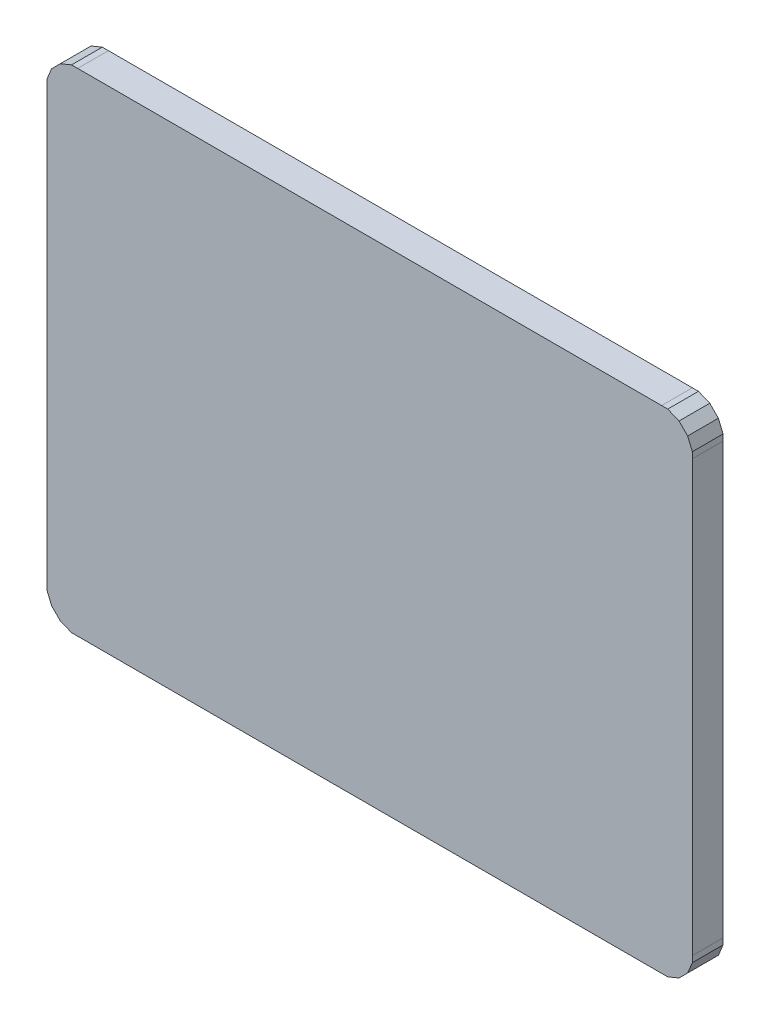
ISO-10303-21;
HEADER;
FILE_DESCRIPTION(('STEP AP214'),'2;1');
FILE_NAME('part.step','',(''),(''),'','','');
FILE_SCHEMA(('AUTOMOTIVE_DESIGN { 1 0 10303 214 1 1 1 1 }'));
ENDSEC;
DATA;
#1=APPLICATION_CONTEXT('core data for automotive mechanical design processes');
#2=APPLICATION_PROTOCOL_DEFINITION('international standard','automotive_design',2000,#1);
#3=PRODUCT_CONTEXT('',#1,'mechanical');
#4=PRODUCT('Part','Part','',(#3));
#5=PRODUCT_RELATED_PRODUCT_CATEGORY('part','',(#4));
#6=PRODUCT_DEFINITION_FORMATION('','',#4);
#7=PRODUCT_DEFINITION_CONTEXT('part definition',#1,'design');
#8=PRODUCT_DEFINITION('design','',#6,#7);
#9=PRODUCT_DEFINITION_SHAPE('','',#8);
#10=(LENGTH_UNIT() NAMED_UNIT(*) SI_UNIT(.MILLI.,.METRE.));
#11=(NAMED_UNIT(*) PLANE_ANGLE_UNIT() SI_UNIT($,.RADIAN.));
#12=(NAMED_UNIT(*) SI_UNIT($,.STERADIAN.) SOLID_ANGLE_UNIT());
#13=UNCERTAINTY_MEASURE_WITH_UNIT(LENGTH_MEASURE(1.E-05),#10,'distance_accuracy_value','');
#14=(GEOMETRIC_REPRESENTATION_CONTEXT(3) GLOBAL_UNCERTAINTY_ASSIGNED_CONTEXT((#13)) GLOBAL_UNIT_ASSIGNED_CONTEXT((#10,
#11,#12)) REPRESENTATION_CONTEXT('',''));
#15=CARTESIAN_POINT('',(0.,0.,0.));
#16=DIRECTION('',(0.,0.,1.));
#17=DIRECTION('',(1.,0.,0.));
#18=AXIS2_PLACEMENT_3D('',#15,#16,#17);
#19=CARTESIAN_POINT('',(-0.95000064,0.80000094,0.0999998));
#20=DIRECTION('',(0.,0.,-1.));
#21=DIRECTION('',(0.,-1.,0.));
#22=AXIS2_PLACEMENT_3D('',#19,#20,#21);
#23=PLANE('',#22);
#24=DIRECTION('',(-1.,0.,0.));
#25=VECTOR('',#24,1.);
#26=CARTESIAN_POINT('',(-0.95000064,0.80000094,0.0999998));
#27=LINE('',#26,#25);
#28=CARTESIAN_POINT('',(-0.95000064,0.80000094,0.0999998));
#29=VERTEX_POINT('',#28);
#30=CARTESIAN_POINT('',(-0.96989392,0.80000094,0.0999998));
#31=VERTEX_POINT('',#30);
#32=EDGE_CURVE('E565',#29,#31,#27,.T.);
#33=ORIENTED_EDGE('',*,*,#32,.T.);
#34=DIRECTION('',(-0.923872088680071,-0.38270140286903,0.));
#35=VECTOR('',#34,1.);
#36=CARTESIAN_POINT('',(-0.96989392,0.80000094,0.0999998));
#37=LINE('',#36,#35);
#38=CARTESIAN_POINT('',(-1.00664772,0.78477618,0.0999998));
#39=VERTEX_POINT('',#38);
#40=EDGE_CURVE('E373',#31,#39,#37,.T.);
#41=ORIENTED_EDGE('',*,*,#40,.T.);
#42=DIRECTION('',(-0.707106781185048,-0.707106781188048,0.));
#43=VECTOR('',#42,1.);
#44=CARTESIAN_POINT('',(-1.00664772,0.78477618,0.0999998));
#45=LINE('',#44,#43);
#46=CARTESIAN_POINT('',(-1.03477822,0.75664568,0.0999998));
#47=VERTEX_POINT('',#46);
#48=EDGE_CURVE('E389',#39,#47,#45,.T.);
#49=ORIENTED_EDGE('',*,*,#48,.T.);
#50=DIRECTION('',(-0.38264690457598,-0.923894661970953,0.));
#51=VECTOR('',#50,1.);
#52=CARTESIAN_POINT('',(-1.03477822,0.75664568,0.0999998));
#53=LINE('',#52,#51);
#54=CARTESIAN_POINT('',(-1.05000044,0.71989188,0.0999998));
#55=VERTEX_POINT('',#54);
#56=EDGE_CURVE('E394',#47,#55,#53,.T.);
#57=ORIENTED_EDGE('',*,*,#56,.T.);
#58=DIRECTION('',(0.,-1.,0.));
#59=VECTOR('',#58,1.);
#60=CARTESIAN_POINT('',(-1.05000044,0.71989188,0.0999998));
#61=LINE('',#60,#59);
#62=CARTESIAN_POINT('',(-1.05000044,0.70000114,0.0999998));
#63=VERTEX_POINT('',#62);
#64=EDGE_CURVE('E407',#55,#63,#61,.T.);
#65=ORIENTED_EDGE('',*,*,#64,.T.);
#66=DIRECTION('',(0.,-1.,0.));
#67=VECTOR('',#66,1.);
#68=CARTESIAN_POINT('',(-1.05000044,0.70000114,0.0999998));
#69=LINE('',#68,#67);
#70=CARTESIAN_POINT('',(-1.05000044,-0.70000114,0.0999998));
#71=VERTEX_POINT('',#70);
#72=EDGE_CURVE('E422',#63,#71,#69,.T.);
#73=ORIENTED_EDGE('',*,*,#72,.T.);
#74=DIRECTION('',(0.,-1.,0.));
#75=VECTOR('',#74,1.);
#76=CARTESIAN_POINT('',(-1.05000044,-0.70000114,0.0999998));
#77=LINE('',#76,#75);
#78=CARTESIAN_POINT('',(-1.05000044,-0.71989442,0.0999998));
#79=VERTEX_POINT('',#78);
#80=EDGE_CURVE('E437',#71,#79,#77,.T.);
#81=ORIENTED_EDGE('',*,*,#80,.T.);
#82=DIRECTION('',(0.382646904575127,-0.923894661971306,0.));
#83=VECTOR('',#82,1.);
#84=CARTESIAN_POINT('',(-1.05000044,-0.71989442,0.0999998));
#85=LINE('',#84,#83);
#86=CARTESIAN_POINT('',(-1.03477822,-0.75664822,0.0999998));
#87=VERTEX_POINT('',#86);
#88=EDGE_CURVE('E384',#79,#87,#85,.T.);
#89=ORIENTED_EDGE('',*,*,#88,.T.);
#90=DIRECTION('',(0.707106781186548,-0.707106781186548,0.));
#91=VECTOR('',#90,1.);
#92=CARTESIAN_POINT('',(-1.03477822,-0.75664822,0.0999998));
#93=LINE('',#92,#91);
#94=CARTESIAN_POINT('',(-1.00664772,-0.78477872,0.0999998));
#95=VERTEX_POINT('',#94);
#96=EDGE_CURVE('E461',#87,#95,#93,.T.);
#97=ORIENTED_EDGE('',*,*,#96,.T.);
#98=DIRECTION('',(0.92389466197216,-0.382646904573066,0.));
#99=VECTOR('',#98,1.);
#100=CARTESIAN_POINT('',(-1.00664772,-0.78477872,0.0999998));
#101=LINE('',#100,#99);
#102=CARTESIAN_POINT('',(-0.96989392,-0.80000094,0.0999998));
#103=VERTEX_POINT('',#102);
#104=EDGE_CURVE('E476',#95,#103,#101,.T.);
#105=ORIENTED_EDGE('',*,*,#104,.T.);
#106=DIRECTION('',(1.,0.,0.));
#107=VECTOR('',#106,1.);
#108=CARTESIAN_POINT('',(-0.96989392,-0.80000094,0.0999998));
#109=LINE('',#108,#107);
#110=CARTESIAN_POINT('',(-0.95000064,-0.80000094,0.0999998));
#111=VERTEX_POINT('',#110);
#112=EDGE_CURVE('E452',#103,#111,#109,.T.);
#113=ORIENTED_EDGE('',*,*,#112,.T.);
#114=DIRECTION('',(1.,0.,0.));
#115=VECTOR('',#114,1.);
#116=CARTESIAN_POINT('',(-0.95000064,-0.80000094,0.0999998));
#117=LINE('',#116,#115);
#118=CARTESIAN_POINT('',(0.95000064,-0.80000094,0.0999998));
#119=VERTEX_POINT('',#118);
#120=EDGE_CURVE('E275',#111,#119,#117,.T.);
#121=ORIENTED_EDGE('',*,*,#120,.T.);
#122=DIRECTION('',(1.,0.,0.));
#123=VECTOR('',#122,1.);
#124=CARTESIAN_POINT('',(0.95000064,-0.80000094,0.0999998));
#125=LINE('',#124,#123);
#126=CARTESIAN_POINT('',(0.96989138,-0.80000094,0.0999998));
#127=VERTEX_POINT('',#126);
#128=EDGE_CURVE('E282',#119,#127,#125,.T.);
#129=ORIENTED_EDGE('',*,*,#128,.T.);
#130=DIRECTION('',(0.923894661971806,0.38264690457392,0.));
#131=VECTOR('',#130,1.);
#132=CARTESIAN_POINT('',(0.96989138,-0.80000094,0.0999998));
#133=LINE('',#132,#131);
#134=CARTESIAN_POINT('',(1.00664518,-0.78477872,0.0999998));
#135=VERTEX_POINT('',#134);
#136=EDGE_CURVE('E297',#127,#135,#133,.T.);
#137=ORIENTED_EDGE('',*,*,#136,.T.);
#138=DIRECTION('',(0.707106781186548,0.707106781186548,0.));
#139=VECTOR('',#138,1.);
#140=CARTESIAN_POINT('',(1.00664518,-0.78477872,0.0999998));
#141=LINE('',#140,#139);
#142=CARTESIAN_POINT('',(1.03477568,-0.75664822,0.0999998));
#143=VERTEX_POINT('',#142);
#144=EDGE_CURVE('E306',#135,#143,#141,.T.);
#145=ORIENTED_EDGE('',*,*,#144,.T.);
#146=DIRECTION('',(0.38270140287109,0.923872088679217,0.));
#147=VECTOR('',#146,1.);
#148=CARTESIAN_POINT('',(1.03477568,-0.75664822,0.0999998));
#149=LINE('',#148,#147);
#150=CARTESIAN_POINT('',(1.05000044,-0.71989442,0.0999998));
#151=VERTEX_POINT('',#150);
#152=EDGE_CURVE('E321',#143,#151,#149,.T.);
#153=ORIENTED_EDGE('',*,*,#152,.T.);
#154=DIRECTION('',(0.,1.,0.));
#155=VECTOR('',#154,1.);
#156=CARTESIAN_POINT('',(1.05000044,-0.71989442,0.0999998));
#157=LINE('',#156,#155);
#158=CARTESIAN_POINT('',(1.05000044,-0.70000114,0.0999998));
#159=VERTEX_POINT('',#158);
#160=EDGE_CURVE('E307',#151,#159,#157,.T.);
#161=ORIENTED_EDGE('',*,*,#160,.T.);
#162=DIRECTION('',(0.,1.,0.));
#163=VECTOR('',#162,1.);
#164=CARTESIAN_POINT('',(1.05000044,-0.70000114,0.0999998));
#165=LINE('',#164,#163);
#166=CARTESIAN_POINT('',(1.05000044,0.70000114,0.0999998));
#167=VERTEX_POINT('',#166);
#168=EDGE_CURVE('E335',#159,#167,#165,.T.);
#169=ORIENTED_EDGE('',*,*,#168,.T.);
#170=DIRECTION('',(0.,1.,0.));
#171=VECTOR('',#170,1.);
#172=CARTESIAN_POINT('',(1.05000044,0.70000114,0.0999998));
#173=LINE('',#172,#171);
#174=CARTESIAN_POINT('',(1.05000044,0.71989188,0.0999998));
#175=VERTEX_POINT('',#174);
#176=EDGE_CURVE('E344',#167,#175,#173,.T.);
#177=ORIENTED_EDGE('',*,*,#176,.T.);
#178=DIRECTION('',(-0.382701402871944,0.923872088678864,0.));
#179=VECTOR('',#178,1.);
#180=CARTESIAN_POINT('',(1.05000044,0.71989188,0.0999998));
#181=LINE('',#180,#179);
#182=CARTESIAN_POINT('',(1.03477568,0.75664568,0.0999998));
#183=VERTEX_POINT('',#182);
#184=EDGE_CURVE('E261',#175,#183,#181,.T.);
#185=ORIENTED_EDGE('',*,*,#184,.T.);
#186=DIRECTION('',(-0.707106781185048,0.707106781188048,0.));
#187=VECTOR('',#186,1.);
#188=CARTESIAN_POINT('',(1.03477568,0.75664568,0.0999998));
#189=LINE('',#188,#187);
#190=CARTESIAN_POINT('',(1.00664518,0.78477618,0.0999998));
#191=VERTEX_POINT('',#190);
#192=EDGE_CURVE('E251',#183,#191,#189,.T.);
#193=ORIENTED_EDGE('',*,*,#192,.T.);
#194=DIRECTION('',(-0.923872088679717,0.382701402869883,0.));
#195=VECTOR('',#194,1.);
#196=CARTESIAN_POINT('',(1.00664518,0.78477618,0.0999998));
#197=LINE('',#196,#195);
#198=CARTESIAN_POINT('',(0.96989138,0.80000094,0.0999998));
#199=VERTEX_POINT('',#198);
#200=EDGE_CURVE('E236',#191,#199,#197,.T.);
#201=ORIENTED_EDGE('',*,*,#200,.T.);
#202=DIRECTION('',(-1.,0.,0.));
#203=VECTOR('',#202,1.);
#204=CARTESIAN_POINT('',(0.96989138,0.80000094,0.0999998));
#205=LINE('',#204,#203);
#206=CARTESIAN_POINT('',(0.95000064,0.80000094,0.0999998));
#207=VERTEX_POINT('',#206);
#208=EDGE_CURVE('E241',#199,#207,#205,.T.);
#209=ORIENTED_EDGE('',*,*,#208,.T.);
#210=DIRECTION('',(-1.,0.,0.));
#211=VECTOR('',#210,1.);
#212=CARTESIAN_POINT('',(0.95000064,0.80000094,0.0999998));
#213=LINE('',#212,#211);
#214=EDGE_CURVE('E11',#207,#29,#213,.T.);
#215=ORIENTED_EDGE('',*,*,#214,.T.);
#216=EDGE_LOOP('',(#33,#41,#49,#57,#65,#73,#81,#89,#97,#105,#113,#121,#129,#137,#145,#153,#161,
#169,#177,#185,#193,#201,#209,#215));
#217=FACE_BOUND('',#216,.T.);
#218=ADVANCED_FACE('F17',(#217),#23,.F.);
#219=CARTESIAN_POINT('',(-0.95000064,0.80000094,0.));
#220=DIRECTION('',(0.,0.,-1.));
#221=DIRECTION('',(0.,-1.,0.));
#222=AXIS2_PLACEMENT_3D('',#219,#220,#221);
#223=PLANE('',#222);
#224=DIRECTION('',(-1.,0.,0.));
#225=VECTOR('',#224,1.);
#226=CARTESIAN_POINT('',(0.95000064,0.80000094,0.));
#227=LINE('',#226,#225);
#228=CARTESIAN_POINT('',(0.95000064,0.80000094,0.));
#229=VERTEX_POINT('',#228);
#230=CARTESIAN_POINT('',(-0.95000064,0.80000094,0.));
#231=VERTEX_POINT('',#230);
#232=EDGE_CURVE('E20',#229,#231,#227,.T.);
#233=ORIENTED_EDGE('',*,*,#232,.F.);
#234=DIRECTION('',(-1.,0.,0.));
#235=VECTOR('',#234,1.);
#236=CARTESIAN_POINT('',(0.96989138,0.80000094,0.));
#237=LINE('',#236,#235);
#238=CARTESIAN_POINT('',(0.96989138,0.80000094,0.));
#239=VERTEX_POINT('',#238);
#240=EDGE_CURVE('E225',#239,#229,#237,.T.);
#241=ORIENTED_EDGE('',*,*,#240,.F.);
#242=DIRECTION('',(-0.923872088679717,0.382701402869883,0.));
#243=VECTOR('',#242,1.);
#244=CARTESIAN_POINT('',(1.00664518,0.78477618,0.));
#245=LINE('',#244,#243);
#246=CARTESIAN_POINT('',(1.00664518,0.78477618,0.));
#247=VERTEX_POINT('',#246);
#248=EDGE_CURVE('E229',#247,#239,#245,.T.);
#249=ORIENTED_EDGE('',*,*,#248,.F.);
#250=DIRECTION('',(-0.707106781185048,0.707106781188048,0.));
#251=VECTOR('',#250,1.);
#252=CARTESIAN_POINT('',(1.03477568,0.75664568,0.));
#253=LINE('',#252,#251);
#254=CARTESIAN_POINT('',(1.03477568,0.75664568,0.));
#255=VERTEX_POINT('',#254);
#256=EDGE_CURVE('E289',#255,#247,#253,.T.);
#257=ORIENTED_EDGE('',*,*,#256,.F.);
#258=DIRECTION('',(-0.382701402871944,0.923872088678864,0.));
#259=VECTOR('',#258,1.);
#260=CARTESIAN_POINT('',(1.05000044,0.71989188,0.));
#261=LINE('',#260,#259);
#262=CARTESIAN_POINT('',(1.05000044,0.71989188,0.));
#263=VERTEX_POINT('',#262);
#264=EDGE_CURVE('E345',#263,#255,#261,.T.);
#265=ORIENTED_EDGE('',*,*,#264,.F.);
#266=DIRECTION('',(0.,1.,0.));
#267=VECTOR('',#266,1.);
#268=CARTESIAN_POINT('',(1.05000044,0.70000114,0.));
#269=LINE('',#268,#267);
#270=CARTESIAN_POINT('',(1.05000044,0.70000114,0.));
#271=VERTEX_POINT('',#270);
#272=EDGE_CURVE('E339',#271,#263,#269,.T.);
#273=ORIENTED_EDGE('',*,*,#272,.F.);
#274=DIRECTION('',(0.,1.,0.));
#275=VECTOR('',#274,1.);
#276=CARTESIAN_POINT('',(1.05000044,-0.70000114,0.));
#277=LINE('',#276,#275);
#278=CARTESIAN_POINT('',(1.05000044,-0.70000114,0.));
#279=VERTEX_POINT('',#278);
#280=EDGE_CURVE('E311',#279,#271,#277,.T.);
#281=ORIENTED_EDGE('',*,*,#280,.F.);
#282=DIRECTION('',(0.,1.,0.));
#283=VECTOR('',#282,1.);
#284=CARTESIAN_POINT('',(1.05000044,-0.71989442,0.));
#285=LINE('',#284,#283);
#286=CARTESIAN_POINT('',(1.05000044,-0.71989442,0.));
#287=VERTEX_POINT('',#286);
#288=EDGE_CURVE('E325',#287,#279,#285,.T.);
#289=ORIENTED_EDGE('',*,*,#288,.F.);
#290=DIRECTION('',(0.38270140287109,0.923872088679217,0.));
#291=VECTOR('',#290,1.);
#292=CARTESIAN_POINT('',(1.03477568,-0.75664822,0.));
#293=LINE('',#292,#291);
#294=CARTESIAN_POINT('',(1.03477568,-0.75664822,0.));
#295=VERTEX_POINT('',#294);
#296=EDGE_CURVE('E316',#295,#287,#293,.T.);
#297=ORIENTED_EDGE('',*,*,#296,.F.);
#298=DIRECTION('',(0.707106781186548,0.707106781186548,0.));
#299=VECTOR('',#298,1.);
#300=CARTESIAN_POINT('',(1.00664518,-0.78477872,0.));
#301=LINE('',#300,#299);
#302=CARTESIAN_POINT('',(1.00664518,-0.78477872,0.));
#303=VERTEX_POINT('',#302);
#304=EDGE_CURVE('E301',#303,#295,#301,.T.);
#305=ORIENTED_EDGE('',*,*,#304,.F.);
#306=DIRECTION('',(0.923894661971806,0.38264690457392,0.));
#307=VECTOR('',#306,1.);
#308=CARTESIAN_POINT('',(0.96989138,-0.80000094,0.));
#309=LINE('',#308,#307);
#310=CARTESIAN_POINT('',(0.96989138,-0.80000094,0.));
#311=VERTEX_POINT('',#310);
#312=EDGE_CURVE('E286',#311,#303,#309,.T.);
#313=ORIENTED_EDGE('',*,*,#312,.F.);
#314=DIRECTION('',(1.,0.,0.));
#315=VECTOR('',#314,1.);
#316=CARTESIAN_POINT('',(0.95000064,-0.80000094,0.));
#317=LINE('',#316,#315);
#318=CARTESIAN_POINT('',(0.95000064,-0.80000094,0.));
#319=VERTEX_POINT('',#318);
#320=EDGE_CURVE('E277',#319,#311,#317,.T.);
#321=ORIENTED_EDGE('',*,*,#320,.F.);
#322=DIRECTION('',(1.,0.,0.));
#323=VECTOR('',#322,1.);
#324=CARTESIAN_POINT('',(-0.95000064,-0.80000094,0.));
#325=LINE('',#324,#323);
#326=CARTESIAN_POINT('',(-0.95000064,-0.80000094,0.));
#327=VERTEX_POINT('',#326);
#328=EDGE_CURVE('E456',#327,#319,#325,.T.);
#329=ORIENTED_EDGE('',*,*,#328,.F.);
#330=DIRECTION('',(1.,0.,0.));
#331=VECTOR('',#330,1.);
#332=CARTESIAN_POINT('',(-0.96989392,-0.80000094,0.));
#333=LINE('',#332,#331);
#334=CARTESIAN_POINT('',(-0.96989392,-0.80000094,0.));
#335=VERTEX_POINT('',#334);
#336=EDGE_CURVE('E480',#335,#327,#333,.T.);
#337=ORIENTED_EDGE('',*,*,#336,.F.);
#338=DIRECTION('',(0.92389466197216,-0.382646904573066,0.));
#339=VECTOR('',#338,1.);
#340=CARTESIAN_POINT('',(-1.00664772,-0.78477872,0.));
#341=LINE('',#340,#339);
#342=CARTESIAN_POINT('',(-1.00664772,-0.78477872,0.));
#343=VERTEX_POINT('',#342);
#344=EDGE_CURVE('E468',#343,#335,#341,.T.);
#345=ORIENTED_EDGE('',*,*,#344,.F.);
#346=DIRECTION('',(0.707106781186548,-0.707106781186548,0.));
#347=VECTOR('',#346,1.);
#348=CARTESIAN_POINT('',(-1.03477822,-0.75664822,0.));
#349=LINE('',#348,#347);
#350=CARTESIAN_POINT('',(-1.03477822,-0.75664822,0.));
#351=VERTEX_POINT('',#350);
#352=EDGE_CURVE('E447',#351,#343,#349,.T.);
#353=ORIENTED_EDGE('',*,*,#352,.F.);
#354=DIRECTION('',(0.382646904575127,-0.923894661971306,0.));
#355=VECTOR('',#354,1.);
#356=CARTESIAN_POINT('',(-1.05000044,-0.71989442,0.));
#357=LINE('',#356,#355);
#358=CARTESIAN_POINT('',(-1.05000044,-0.71989442,0.));
#359=VERTEX_POINT('',#358);
#360=EDGE_CURVE('E385',#359,#351,#357,.T.);
#361=ORIENTED_EDGE('',*,*,#360,.F.);
#362=DIRECTION('',(0.,-1.,0.));
#363=VECTOR('',#362,1.);
#364=CARTESIAN_POINT('',(-1.05000044,-0.70000114,0.));
#365=LINE('',#364,#363);
#366=CARTESIAN_POINT('',(-1.05000044,-0.70000114,0.));
#367=VERTEX_POINT('',#366);
#368=EDGE_CURVE('E426',#367,#359,#365,.T.);
#369=ORIENTED_EDGE('',*,*,#368,.F.);
#370=DIRECTION('',(0.,-1.,0.));
#371=VECTOR('',#370,1.);
#372=CARTESIAN_POINT('',(-1.05000044,0.70000114,0.));
#373=LINE('',#372,#371);
#374=CARTESIAN_POINT('',(-1.05000044,0.70000114,0.));
#375=VERTEX_POINT('',#374);
#376=EDGE_CURVE('E414',#375,#367,#373,.T.);
#377=ORIENTED_EDGE('',*,*,#376,.F.);
#378=DIRECTION('',(0.,-1.,0.));
#379=VECTOR('',#378,1.);
#380=CARTESIAN_POINT('',(-1.05000044,0.71989188,0.));
#381=LINE('',#380,#379);
#382=CARTESIAN_POINT('',(-1.05000044,0.71989188,0.));
#383=VERTEX_POINT('',#382);
#384=EDGE_CURVE('E396',#383,#375,#381,.T.);
#385=ORIENTED_EDGE('',*,*,#384,.F.);
#386=DIRECTION('',(-0.38264690457598,-0.923894661970953,0.));
#387=VECTOR('',#386,1.);
#388=CARTESIAN_POINT('',(-1.03477822,0.75664568,0.));
#389=LINE('',#388,#387);
#390=CARTESIAN_POINT('',(-1.03477822,0.75664568,0.));
#391=VERTEX_POINT('',#390);
#392=EDGE_CURVE('E395',#391,#383,#389,.T.);
#393=ORIENTED_EDGE('',*,*,#392,.F.);
#394=DIRECTION('',(-0.707106781185048,-0.707106781188048,0.));
#395=VECTOR('',#394,1.);
#396=CARTESIAN_POINT('',(-1.00664772,0.78477618,0.));
#397=LINE('',#396,#395);
#398=CARTESIAN_POINT('',(-1.00664772,0.78477618,0.));
#399=VERTEX_POINT('',#398);
#400=EDGE_CURVE('E375',#399,#391,#397,.T.);
#401=ORIENTED_EDGE('',*,*,#400,.F.);
#402=DIRECTION('',(-0.923872088680071,-0.38270140286903,0.));
#403=VECTOR('',#402,1.);
#404=CARTESIAN_POINT('',(-0.96989392,0.80000094,0.));
#405=LINE('',#404,#403);
#406=CARTESIAN_POINT('',(-0.96989392,0.80000094,0.));
#407=VERTEX_POINT('',#406);
#408=EDGE_CURVE('E545',#407,#399,#405,.T.);
#409=ORIENTED_EDGE('',*,*,#408,.F.);
#410=DIRECTION('',(-1.,0.,0.));
#411=VECTOR('',#410,1.);
#412=CARTESIAN_POINT('',(-0.95000064,0.80000094,0.));
#413=LINE('',#412,#411);
#414=EDGE_CURVE('E975',#231,#407,#413,.T.);
#415=ORIENTED_EDGE('',*,*,#414,.F.);
#416=EDGE_LOOP('',(#233,#241,#249,#257,#265,#273,#281,#289,#297,#305,#313,#321,#329,#337,#345,
#353,#361,#369,#377,#385,#393,#401,#409,#415));
#417=FACE_BOUND('',#416,.T.);
#418=ADVANCED_FACE('F227',(#417),#223,.T.);
#419=CARTESIAN_POINT('',(0.95000064,0.80000094,0.));
#420=DIRECTION('',(0.,-1.,0.));
#421=DIRECTION('',(0.,0.,-1.));
#422=AXIS2_PLACEMENT_3D('',#419,#420,#421);
#423=PLANE('',#422);
#424=ORIENTED_EDGE('',*,*,#232,.T.);
#425=DIRECTION('',(0.,0.,1.));
#426=VECTOR('',#425,1.);
#427=CARTESIAN_POINT('',(-0.95000064,0.80000094,0.));
#428=LINE('',#427,#426);
#429=EDGE_CURVE('E560',#231,#29,#428,.T.);
#430=ORIENTED_EDGE('',*,*,#429,.T.);
#431=ORIENTED_EDGE('',*,*,#214,.F.);
#432=DIRECTION('',(0.,0.,1.));
#433=VECTOR('',#432,1.);
#434=CARTESIAN_POINT('',(0.95000064,0.80000094,0.));
#435=LINE('',#434,#433);
#436=EDGE_CURVE('E235',#229,#207,#435,.T.);
#437=ORIENTED_EDGE('',*,*,#436,.F.);
#438=EDGE_LOOP('',(#424,#430,#431,#437));
#439=FACE_BOUND('',#438,.T.);
#440=ADVANCED_FACE('F747',(#439),#423,.F.);
#441=CARTESIAN_POINT('',(0.96989138,0.80000094,0.));
#442=DIRECTION('',(0.,-1.,0.));
#443=DIRECTION('',(0.,0.,-1.));
#444=AXIS2_PLACEMENT_3D('',#441,#442,#443);
#445=PLANE('',#444);
#446=ORIENTED_EDGE('',*,*,#240,.T.);
#447=ORIENTED_EDGE('',*,*,#436,.T.);
#448=ORIENTED_EDGE('',*,*,#208,.F.);
#449=DIRECTION('',(0.,0.,1.));
#450=VECTOR('',#449,1.);
#451=CARTESIAN_POINT('',(0.96989138,0.80000094,0.));
#452=LINE('',#451,#450);
#453=EDGE_CURVE('E239',#239,#199,#452,.T.);
#454=ORIENTED_EDGE('',*,*,#453,.F.);
#455=EDGE_LOOP('',(#446,#447,#448,#454));
#456=FACE_BOUND('',#455,.T.);
#457=ADVANCED_FACE('F240',(#456),#445,.F.);
#458=CARTESIAN_POINT('',(1.00664518,0.78477618,0.));
#459=DIRECTION('',(-0.382701402869883,-0.923872088679717,0.));
#460=DIRECTION('',(-0.923872088679717,0.382701402869883,0.));
#461=AXIS2_PLACEMENT_3D('',#458,#459,#460);
#462=PLANE('',#461);
#463=ORIENTED_EDGE('',*,*,#248,.T.);
#464=ORIENTED_EDGE('',*,*,#453,.T.);
#465=ORIENTED_EDGE('',*,*,#200,.F.);
#466=DIRECTION('',(0.,0.,1.));
#467=VECTOR('',#466,1.);
#468=CARTESIAN_POINT('',(1.00664518,0.78477618,0.));
#469=LINE('',#468,#467);
#470=EDGE_CURVE('E248',#247,#191,#469,.T.);
#471=ORIENTED_EDGE('',*,*,#470,.F.);
#472=EDGE_LOOP('',(#463,#464,#465,#471));
#473=FACE_BOUND('',#472,.T.);
#474=ADVANCED_FACE('F246',(#473),#462,.F.);
#475=CARTESIAN_POINT('',(1.03477568,0.75664568,0.));
#476=DIRECTION('',(-0.707106781188048,-0.707106781185048,0.));
#477=DIRECTION('',(-0.707106781185048,0.707106781188048,0.));
#478=AXIS2_PLACEMENT_3D('',#475,#476,#477);
#479=PLANE('',#478);
#480=ORIENTED_EDGE('',*,*,#256,.T.);
#481=ORIENTED_EDGE('',*,*,#470,.T.);
#482=ORIENTED_EDGE('',*,*,#192,.F.);
#483=DIRECTION('',(0.,0.,1.));
#484=VECTOR('',#483,1.);
#485=CARTESIAN_POINT('',(1.03477568,0.75664568,0.));
#486=LINE('',#485,#484);
#487=EDGE_CURVE('E348',#255,#183,#486,.T.);
#488=ORIENTED_EDGE('',*,*,#487,.F.);
#489=EDGE_LOOP('',(#480,#481,#482,#488));
#490=FACE_BOUND('',#489,.T.);
#491=ADVANCED_FACE('F862',(#490),#479,.F.);
#492=CARTESIAN_POINT('',(1.05000044,0.71989188,0.));
#493=DIRECTION('',(-0.923872088678864,-0.382701402871944,0.));
#494=DIRECTION('',(-0.382701402871944,0.923872088678864,0.));
#495=AXIS2_PLACEMENT_3D('',#492,#493,#494);
#496=PLANE('',#495);
#497=ORIENTED_EDGE('',*,*,#264,.T.);
#498=ORIENTED_EDGE('',*,*,#487,.T.);
#499=ORIENTED_EDGE('',*,*,#184,.F.);
#500=DIRECTION('',(0.,0.,1.));
#501=VECTOR('',#500,1.);
#502=CARTESIAN_POINT('',(1.05000044,0.71989188,0.));
#503=LINE('',#502,#501);
#504=EDGE_CURVE('E340',#263,#175,#503,.T.);
#505=ORIENTED_EDGE('',*,*,#504,.F.);
#506=EDGE_LOOP('',(#497,#498,#499,#505));
#507=FACE_BOUND('',#506,.T.);
#508=ADVANCED_FACE('F362',(#507),#496,.F.);
#509=CARTESIAN_POINT('',(1.05000044,0.70000114,0.));
#510=DIRECTION('',(-1.,0.,0.));
#511=DIRECTION('',(0.,0.,1.));
#512=AXIS2_PLACEMENT_3D('',#509,#510,#511);
#513=PLANE('',#512);
#514=ORIENTED_EDGE('',*,*,#272,.T.);
#515=ORIENTED_EDGE('',*,*,#504,.T.);
#516=ORIENTED_EDGE('',*,*,#176,.F.);
#517=DIRECTION('',(0.,0.,1.));
#518=VECTOR('',#517,1.);
#519=CARTESIAN_POINT('',(1.05000044,0.70000114,0.));
#520=LINE('',#519,#518);
#521=EDGE_CURVE('E329',#271,#167,#520,.T.);
#522=ORIENTED_EDGE('',*,*,#521,.F.);
#523=EDGE_LOOP('',(#514,#515,#516,#522));
#524=FACE_BOUND('',#523,.T.);
#525=ADVANCED_FACE('F366',(#524),#513,.F.);
#526=CARTESIAN_POINT('',(1.05000044,-0.70000114,0.));
#527=DIRECTION('',(-1.,0.,0.));
#528=DIRECTION('',(0.,0.,1.));
#529=AXIS2_PLACEMENT_3D('',#526,#527,#528);
#530=PLANE('',#529);
#531=ORIENTED_EDGE('',*,*,#280,.T.);
#532=ORIENTED_EDGE('',*,*,#521,.T.);
#533=ORIENTED_EDGE('',*,*,#168,.F.);
#534=DIRECTION('',(0.,0.,1.));
#535=VECTOR('',#534,1.);
#536=CARTESIAN_POINT('',(1.05000044,-0.70000114,0.));
#537=LINE('',#536,#535);
#538=EDGE_CURVE('E312',#279,#159,#537,.T.);
#539=ORIENTED_EDGE('',*,*,#538,.F.);
#540=EDGE_LOOP('',(#531,#532,#533,#539));
#541=FACE_BOUND('',#540,.T.);
#542=ADVANCED_FACE('F708',(#541),#530,.F.);
#543=CARTESIAN_POINT('',(1.05000044,-0.71989442,0.));
#544=DIRECTION('',(-1.,0.,0.));
#545=DIRECTION('',(0.,0.,1.));
#546=AXIS2_PLACEMENT_3D('',#543,#544,#545);
#547=PLANE('',#546);
#548=ORIENTED_EDGE('',*,*,#288,.T.);
#549=ORIENTED_EDGE('',*,*,#538,.T.);
#550=ORIENTED_EDGE('',*,*,#160,.F.);
#551=DIRECTION('',(0.,0.,1.));
#552=VECTOR('',#551,1.);
#553=CARTESIAN_POINT('',(1.05000044,-0.71989442,0.));
#554=LINE('',#553,#552);
#555=EDGE_CURVE('E317',#287,#151,#554,.T.);
#556=ORIENTED_EDGE('',*,*,#555,.F.);
#557=EDGE_LOOP('',(#548,#549,#550,#556));
#558=FACE_BOUND('',#557,.T.);
#559=ADVANCED_FACE('F703',(#558),#547,.F.);
#560=CARTESIAN_POINT('',(1.03477568,-0.75664822,0.));
#561=DIRECTION('',(-0.923872088679217,0.38270140287109,0.));
#562=DIRECTION('',(0.,0.,1.));
#563=AXIS2_PLACEMENT_3D('',#560,#561,#562);
#564=PLANE('',#563);
#565=ORIENTED_EDGE('',*,*,#296,.T.);
#566=ORIENTED_EDGE('',*,*,#555,.T.);
#567=ORIENTED_EDGE('',*,*,#152,.F.);
#568=DIRECTION('',(0.,0.,1.));
#569=VECTOR('',#568,1.);
#570=CARTESIAN_POINT('',(1.03477568,-0.75664822,0.));
#571=LINE('',#570,#569);
#572=EDGE_CURVE('E302',#295,#143,#571,.T.);
#573=ORIENTED_EDGE('',*,*,#572,.F.);
#574=EDGE_LOOP('',(#565,#566,#567,#573));
#575=FACE_BOUND('',#574,.T.);
#576=ADVANCED_FACE('F507',(#575),#564,.F.);
#577=CARTESIAN_POINT('',(1.00664518,-0.78477872,0.));
#578=DIRECTION('',(-0.707106781186548,0.707106781186548,0.));
#579=DIRECTION('',(0.,0.,1.));
#580=AXIS2_PLACEMENT_3D('',#577,#578,#579);
#581=PLANE('',#580);
#582=ORIENTED_EDGE('',*,*,#304,.T.);
#583=ORIENTED_EDGE('',*,*,#572,.T.);
#584=ORIENTED_EDGE('',*,*,#144,.F.);
#585=DIRECTION('',(0.,0.,1.));
#586=VECTOR('',#585,1.);
#587=CARTESIAN_POINT('',(1.00664518,-0.78477872,0.));
#588=LINE('',#587,#586);
#589=EDGE_CURVE('E292',#303,#135,#588,.T.);
#590=ORIENTED_EDGE('',*,*,#589,.F.);
#591=EDGE_LOOP('',(#582,#583,#584,#590));
#592=FACE_BOUND('',#591,.T.);
#593=ADVANCED_FACE('F499',(#592),#581,.F.);
#594=CARTESIAN_POINT('',(0.96989138,-0.80000094,0.));
#595=DIRECTION('',(-0.38264690457392,0.923894661971806,0.));
#596=DIRECTION('',(0.,0.,1.));
#597=AXIS2_PLACEMENT_3D('',#594,#595,#596);
#598=PLANE('',#597);
#599=ORIENTED_EDGE('',*,*,#312,.T.);
#600=ORIENTED_EDGE('',*,*,#589,.T.);
#601=ORIENTED_EDGE('',*,*,#136,.F.);
#602=DIRECTION('',(0.,0.,1.));
#603=VECTOR('',#602,1.);
#604=CARTESIAN_POINT('',(0.96989138,-0.80000094,0.));
#605=LINE('',#604,#603);
#606=EDGE_CURVE('E281',#311,#127,#605,.T.);
#607=ORIENTED_EDGE('',*,*,#606,.F.);
#608=EDGE_LOOP('',(#599,#600,#601,#607));
#609=FACE_BOUND('',#608,.T.);
#610=ADVANCED_FACE('F510',(#609),#598,.F.);
#611=CARTESIAN_POINT('',(0.95000064,-0.80000094,0.));
#612=DIRECTION('',(0.,1.,0.));
#613=DIRECTION('',(1.,0.,0.));
#614=AXIS2_PLACEMENT_3D('',#611,#612,#613);
#615=PLANE('',#614);
#616=ORIENTED_EDGE('',*,*,#320,.T.);
#617=ORIENTED_EDGE('',*,*,#606,.T.);
#618=ORIENTED_EDGE('',*,*,#128,.F.);
#619=DIRECTION('',(0.,0.,1.));
#620=VECTOR('',#619,1.);
#621=CARTESIAN_POINT('',(0.95000064,-0.80000094,0.));
#622=LINE('',#621,#620);
#623=EDGE_CURVE('E490',#319,#119,#622,.T.);
#624=ORIENTED_EDGE('',*,*,#623,.F.);
#625=EDGE_LOOP('',(#616,#617,#618,#624));
#626=FACE_BOUND('',#625,.T.);
#627=ADVANCED_FACE('F513',(#626),#615,.F.);
#628=CARTESIAN_POINT('',(-0.95000064,-0.80000094,0.));
#629=DIRECTION('',(0.,1.,0.));
#630=DIRECTION('',(1.,0.,0.));
#631=AXIS2_PLACEMENT_3D('',#628,#629,#630);
#632=PLANE('',#631);
#633=ORIENTED_EDGE('',*,*,#328,.T.);
#634=ORIENTED_EDGE('',*,*,#623,.T.);
#635=ORIENTED_EDGE('',*,*,#120,.F.);
#636=DIRECTION('',(0.,0.,1.));
#637=VECTOR('',#636,1.);
#638=CARTESIAN_POINT('',(-0.95000064,-0.80000094,0.));
#639=LINE('',#638,#637);
#640=EDGE_CURVE('E457',#327,#111,#639,.T.);
#641=ORIENTED_EDGE('',*,*,#640,.F.);
#642=EDGE_LOOP('',(#633,#634,#635,#641));
#643=FACE_BOUND('',#642,.T.);
#644=ADVANCED_FACE('F517',(#643),#632,.F.);
#645=CARTESIAN_POINT('',(-0.96989392,-0.80000094,0.));
#646=DIRECTION('',(0.,1.,0.));
#647=DIRECTION('',(1.,0.,0.));
#648=AXIS2_PLACEMENT_3D('',#645,#646,#647);
#649=PLANE('',#648);
#650=ORIENTED_EDGE('',*,*,#336,.T.);
#651=ORIENTED_EDGE('',*,*,#640,.T.);
#652=ORIENTED_EDGE('',*,*,#112,.F.);
#653=DIRECTION('',(0.,0.,1.));
#654=VECTOR('',#653,1.);
#655=CARTESIAN_POINT('',(-0.96989392,-0.80000094,0.));
#656=LINE('',#655,#654);
#657=EDGE_CURVE('E472',#335,#103,#656,.T.);
#658=ORIENTED_EDGE('',*,*,#657,.F.);
#659=EDGE_LOOP('',(#650,#651,#652,#658));
#660=FACE_BOUND('',#659,.T.);
#661=ADVANCED_FACE('F519',(#660),#649,.F.);
#662=CARTESIAN_POINT('',(-1.00664772,-0.78477872,0.));
#663=DIRECTION('',(0.382646904573066,0.92389466197216,0.));
#664=DIRECTION('',(0.,0.,-1.));
#665=AXIS2_PLACEMENT_3D('',#662,#663,#664);
#666=PLANE('',#665);
#667=ORIENTED_EDGE('',*,*,#344,.T.);
#668=ORIENTED_EDGE('',*,*,#657,.T.);
#669=ORIENTED_EDGE('',*,*,#104,.F.);
#670=DIRECTION('',(0.,0.,1.));
#671=VECTOR('',#670,1.);
#672=CARTESIAN_POINT('',(-1.00664772,-0.78477872,0.));
#673=LINE('',#672,#671);
#674=EDGE_CURVE('E451',#343,#95,#673,.T.);
#675=ORIENTED_EDGE('',*,*,#674,.F.);
#676=EDGE_LOOP('',(#667,#668,#669,#675));
#677=FACE_BOUND('',#676,.T.);
#678=ADVANCED_FACE('F522',(#677),#666,.F.);
#679=CARTESIAN_POINT('',(-1.03477822,-0.75664822,0.));
#680=DIRECTION('',(0.707106781186548,0.707106781186548,0.));
#681=DIRECTION('',(0.,0.,-1.));
#682=AXIS2_PLACEMENT_3D('',#679,#680,#681);
#683=PLANE('',#682);
#684=ORIENTED_EDGE('',*,*,#352,.T.);
#685=ORIENTED_EDGE('',*,*,#674,.T.);
#686=ORIENTED_EDGE('',*,*,#96,.F.);
#687=DIRECTION('',(0.,0.,1.));
#688=VECTOR('',#687,1.);
#689=CARTESIAN_POINT('',(-1.03477822,-0.75664822,0.));
#690=LINE('',#689,#688);
#691=EDGE_CURVE('E380',#351,#87,#690,.T.);
#692=ORIENTED_EDGE('',*,*,#691,.F.);
#693=EDGE_LOOP('',(#684,#685,#686,#692));
#694=FACE_BOUND('',#693,.T.);
#695=ADVANCED_FACE('F526',(#694),#683,.F.);
#696=CARTESIAN_POINT('',(-1.05000044,-0.71989442,0.));
#697=DIRECTION('',(0.923894661971306,0.382646904575127,0.));
#698=DIRECTION('',(0.,0.,-1.));
#699=AXIS2_PLACEMENT_3D('',#696,#697,#698);
#700=PLANE('',#699);
#701=ORIENTED_EDGE('',*,*,#360,.T.);
#702=ORIENTED_EDGE('',*,*,#691,.T.);
#703=ORIENTED_EDGE('',*,*,#88,.F.);
#704=DIRECTION('',(0.,0.,1.));
#705=VECTOR('',#704,1.);
#706=CARTESIAN_POINT('',(-1.05000044,-0.71989442,0.));
#707=LINE('',#706,#705);
#708=EDGE_CURVE('E430',#359,#79,#707,.T.);
#709=ORIENTED_EDGE('',*,*,#708,.F.);
#710=EDGE_LOOP('',(#701,#702,#703,#709));
#711=FACE_BOUND('',#710,.T.);
#712=ADVANCED_FACE('F528',(#711),#700,.F.);
#713=CARTESIAN_POINT('',(-1.05000044,-0.70000114,0.));
#714=DIRECTION('',(1.,0.,0.));
#715=DIRECTION('',(0.,1.,0.));
#716=AXIS2_PLACEMENT_3D('',#713,#714,#715);
#717=PLANE('',#716);
#718=ORIENTED_EDGE('',*,*,#368,.T.);
#719=ORIENTED_EDGE('',*,*,#708,.T.);
#720=ORIENTED_EDGE('',*,*,#80,.F.);
#721=DIRECTION('',(0.,0.,1.));
#722=VECTOR('',#721,1.);
#723=CARTESIAN_POINT('',(-1.05000044,-0.70000114,0.));
#724=LINE('',#723,#722);
#725=EDGE_CURVE('E418',#367,#71,#724,.T.);
#726=ORIENTED_EDGE('',*,*,#725,.F.);
#727=EDGE_LOOP('',(#718,#719,#720,#726));
#728=FACE_BOUND('',#727,.T.);
#729=ADVANCED_FACE('F531',(#728),#717,.F.);
#730=CARTESIAN_POINT('',(-1.05000044,0.70000114,0.));
#731=DIRECTION('',(1.,0.,0.));
#732=DIRECTION('',(0.,1.,0.));
#733=AXIS2_PLACEMENT_3D('',#730,#731,#732);
#734=PLANE('',#733);
#735=ORIENTED_EDGE('',*,*,#376,.T.);
#736=ORIENTED_EDGE('',*,*,#725,.T.);
#737=ORIENTED_EDGE('',*,*,#72,.F.);
#738=DIRECTION('',(0.,0.,1.));
#739=VECTOR('',#738,1.);
#740=CARTESIAN_POINT('',(-1.05000044,0.70000114,0.));
#741=LINE('',#740,#739);
#742=EDGE_CURVE('E399',#375,#63,#741,.T.);
#743=ORIENTED_EDGE('',*,*,#742,.F.);
#744=EDGE_LOOP('',(#735,#736,#737,#743));
#745=FACE_BOUND('',#744,.T.);
#746=ADVANCED_FACE('F535',(#745),#734,.F.);
#747=CARTESIAN_POINT('',(-1.05000044,0.71989188,0.));
#748=DIRECTION('',(1.,0.,0.));
#749=DIRECTION('',(0.,1.,0.));
#750=AXIS2_PLACEMENT_3D('',#747,#748,#749);
#751=PLANE('',#750);
#752=ORIENTED_EDGE('',*,*,#384,.T.);
#753=ORIENTED_EDGE('',*,*,#742,.T.);
#754=ORIENTED_EDGE('',*,*,#64,.F.);
#755=DIRECTION('',(0.,0.,1.));
#756=VECTOR('',#755,1.);
#757=CARTESIAN_POINT('',(-1.05000044,0.71989188,0.));
#758=LINE('',#757,#756);
#759=EDGE_CURVE('E390',#383,#55,#758,.T.);
#760=ORIENTED_EDGE('',*,*,#759,.F.);
#761=EDGE_LOOP('',(#752,#753,#754,#760));
#762=FACE_BOUND('',#761,.T.);
#763=ADVANCED_FACE('F538',(#762),#751,.F.);
#764=CARTESIAN_POINT('',(-1.03477822,0.75664568,0.));
#765=DIRECTION('',(0.923894661970953,-0.38264690457598,0.));
#766=DIRECTION('',(0.,0.,-1.));
#767=AXIS2_PLACEMENT_3D('',#764,#765,#766);
#768=PLANE('',#767);
#769=ORIENTED_EDGE('',*,*,#392,.T.);
#770=ORIENTED_EDGE('',*,*,#759,.T.);
#771=ORIENTED_EDGE('',*,*,#56,.F.);
#772=DIRECTION('',(0.,0.,1.));
#773=VECTOR('',#772,1.);
#774=CARTESIAN_POINT('',(-1.03477822,0.75664568,0.));
#775=LINE('',#774,#773);
#776=EDGE_CURVE('E379',#391,#47,#775,.T.);
#777=ORIENTED_EDGE('',*,*,#776,.F.);
#778=EDGE_LOOP('',(#769,#770,#771,#777));
#779=FACE_BOUND('',#778,.T.);
#780=ADVANCED_FACE('F542',(#779),#768,.F.);
#781=CARTESIAN_POINT('',(-1.00664772,0.78477618,0.));
#782=DIRECTION('',(0.707106781188048,-0.707106781185048,0.));
#783=DIRECTION('',(0.,0.,-1.));
#784=AXIS2_PLACEMENT_3D('',#781,#782,#783);
#785=PLANE('',#784);
#786=ORIENTED_EDGE('',*,*,#400,.T.);
#787=ORIENTED_EDGE('',*,*,#776,.T.);
#788=ORIENTED_EDGE('',*,*,#48,.F.);
#789=DIRECTION('',(0.,0.,1.));
#790=VECTOR('',#789,1.);
#791=CARTESIAN_POINT('',(-1.00664772,0.78477618,0.));
#792=LINE('',#791,#790);
#793=EDGE_CURVE('E549',#399,#39,#792,.T.);
#794=ORIENTED_EDGE('',*,*,#793,.F.);
#795=EDGE_LOOP('',(#786,#787,#788,#794));
#796=FACE_BOUND('',#795,.T.);
#797=ADVANCED_FACE('F550',(#796),#785,.F.);
#798=CARTESIAN_POINT('',(-0.96989392,0.80000094,0.));
#799=DIRECTION('',(0.38270140286903,-0.923872088680071,0.));
#800=DIRECTION('',(0.,0.,-1.));
#801=AXIS2_PLACEMENT_3D('',#798,#799,#800);
#802=PLANE('',#801);
#803=ORIENTED_EDGE('',*,*,#408,.T.);
#804=ORIENTED_EDGE('',*,*,#793,.T.);
#805=ORIENTED_EDGE('',*,*,#40,.F.);
#806=DIRECTION('',(0.,0.,1.));
#807=VECTOR('',#806,1.);
#808=CARTESIAN_POINT('',(-0.96989392,0.80000094,0.));
#809=LINE('',#808,#807);
#810=EDGE_CURVE('E557',#407,#31,#809,.T.);
#811=ORIENTED_EDGE('',*,*,#810,.F.);
#812=EDGE_LOOP('',(#803,#804,#805,#811));
#813=FACE_BOUND('',#812,.T.);
#814=ADVANCED_FACE('F555',(#813),#802,.F.);
#815=CARTESIAN_POINT('',(-0.95000064,0.80000094,0.));
#816=DIRECTION('',(0.,-1.,0.));
#817=DIRECTION('',(0.,0.,-1.));
#818=AXIS2_PLACEMENT_3D('',#815,#816,#817);
#819=PLANE('',#818);
#820=ORIENTED_EDGE('',*,*,#414,.T.);
#821=ORIENTED_EDGE('',*,*,#810,.T.);
#822=ORIENTED_EDGE('',*,*,#32,.F.);
#823=ORIENTED_EDGE('',*,*,#429,.F.);
#824=EDGE_LOOP('',(#820,#821,#822,#823));
#825=FACE_BOUND('',#824,.T.);
#826=ADVANCED_FACE('F715',(#825),#819,.F.);
#827=CLOSED_SHELL('',(#218,#418,#440,#457,#474,#491,#508,#525,#542,#559,#576,#593,#610,#627,
#644,#661,#678,#695,#712,#729,#746,#763,#780,#797,#814,#826));
#828=MANIFOLD_SOLID_BREP('B1',#827);
#829=ADVANCED_BREP_SHAPE_REPRESENTATION('',(#18,#828),#14);
#830=SHAPE_DEFINITION_REPRESENTATION(#9,#829);
ENDSEC;
END-ISO-10303-21;
